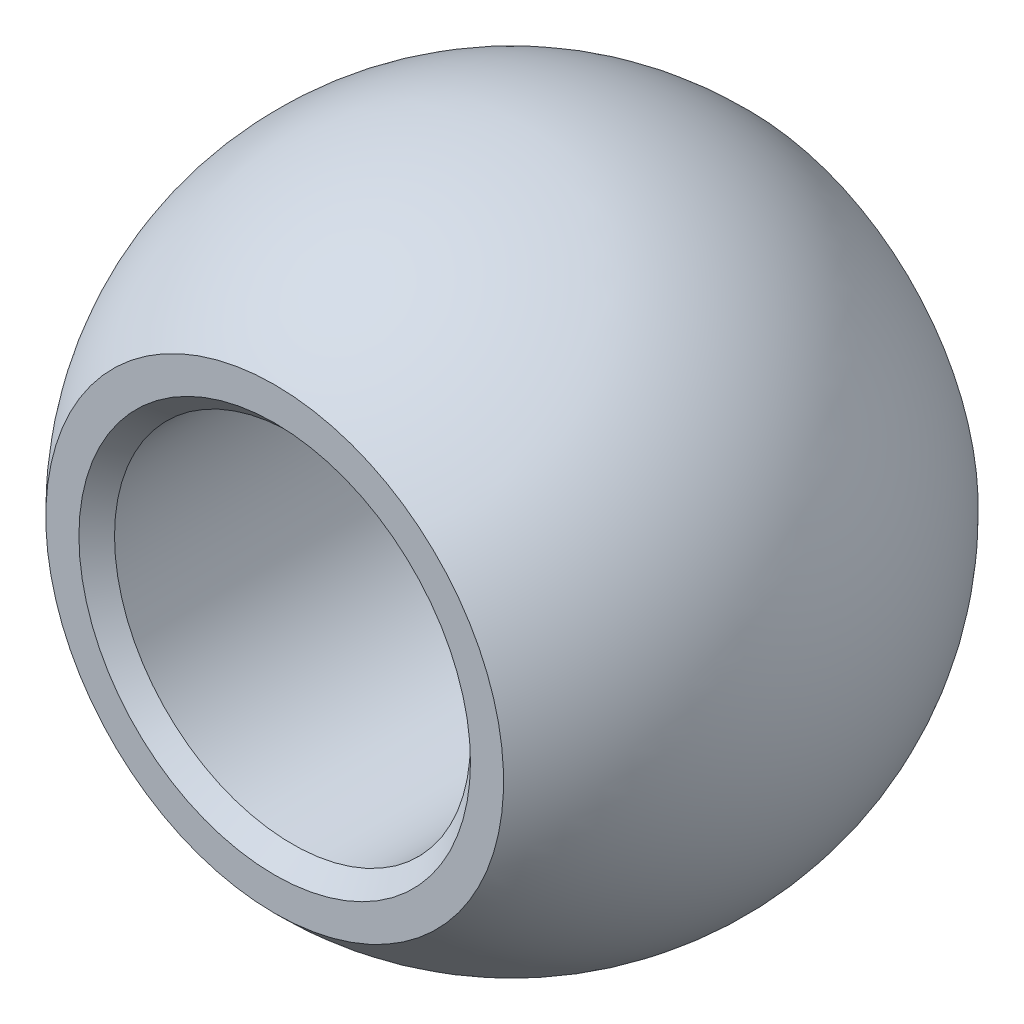
ISO-10303-21;
HEADER;
FILE_DESCRIPTION(('STEP AP214'),'2;1');
FILE_NAME('part.step','',(''),(''),'','','');
FILE_SCHEMA(('AUTOMOTIVE_DESIGN { 1 0 10303 214 1 1 1 1 }'));
ENDSEC;
DATA;
#1=APPLICATION_CONTEXT('core data for automotive mechanical design processes');
#2=APPLICATION_PROTOCOL_DEFINITION('international standard','automotive_design',2000,#1);
#3=PRODUCT_CONTEXT('',#1,'mechanical');
#4=PRODUCT('Part','Part','',(#3));
#5=PRODUCT_RELATED_PRODUCT_CATEGORY('part','',(#4));
#6=PRODUCT_DEFINITION_FORMATION('','',#4);
#7=PRODUCT_DEFINITION_CONTEXT('part definition',#1,'design');
#8=PRODUCT_DEFINITION('design','',#6,#7);
#9=PRODUCT_DEFINITION_SHAPE('','',#8);
#10=(LENGTH_UNIT() NAMED_UNIT(*) SI_UNIT(.MILLI.,.METRE.));
#11=(NAMED_UNIT(*) PLANE_ANGLE_UNIT() SI_UNIT($,.RADIAN.));
#12=(NAMED_UNIT(*) SI_UNIT($,.STERADIAN.) SOLID_ANGLE_UNIT());
#13=UNCERTAINTY_MEASURE_WITH_UNIT(LENGTH_MEASURE(1.E-05),#10,'distance_accuracy_value','');
#14=(GEOMETRIC_REPRESENTATION_CONTEXT(3) GLOBAL_UNCERTAINTY_ASSIGNED_CONTEXT((#13)) GLOBAL_UNIT_ASSIGNED_CONTEXT((#10,
#11,#12)) REPRESENTATION_CONTEXT('',''));
#15=CARTESIAN_POINT('',(0.,0.,0.));
#16=DIRECTION('',(0.,0.,1.));
#17=DIRECTION('',(1.,0.,0.));
#18=AXIS2_PLACEMENT_3D('',#15,#16,#17);
#19=CARTESIAN_POINT('',(0.,0.,0.));
#20=DIRECTION('',(0.,1.,0.));
#21=DIRECTION('',(1.,0.,0.));
#22=AXIS2_PLACEMENT_3D('',#19,#20,#21);
#23=SPHERICAL_SURFACE('',#22,11.115);
#24=CARTESIAN_POINT('',(0.,0.,0.));
#25=DIRECTION('',(0.,0.,1.));
#26=DIRECTION('',(0.,-1.,0.));
#27=AXIS2_PLACEMENT_3D('',#24,#25,#26);
#28=SPHERICAL_SURFACE('',#27,11.115);
#29=CARTESIAN_POINT('',(0.,0.,-8.));
#30=DIRECTION('',(0.,0.,1.));
#31=DIRECTION('',(0.,-1.,0.));
#32=AXIS2_PLACEMENT_3D('',#29,#30,#31);
#33=CIRCLE('',#32,7.71642566218324);
#34=CARTESIAN_POINT('',(0.,-7.71642566218324,-8.));
#35=VERTEX_POINT('',#34);
#36=EDGE_CURVE('E59',#35,#35,#33,.T.);
#37=ORIENTED_EDGE('',*,*,#36,.T.);
#38=EDGE_LOOP('',(#37));
#39=FACE_BOUND('',#38,.T.);
#40=CARTESIAN_POINT('',(0.,0.,8.));
#41=DIRECTION('',(0.,0.,-1.));
#42=DIRECTION('',(0.,1.,0.));
#43=AXIS2_PLACEMENT_3D('',#40,#41,#42);
#44=CIRCLE('',#43,7.71642566218323);
#45=CARTESIAN_POINT('',(0.,7.71642566218323,8.00000000000001));
#46=VERTEX_POINT('',#45);
#47=EDGE_CURVE('E58',#46,#46,#44,.T.);
#48=ORIENTED_EDGE('',*,*,#47,.T.);
#49=EDGE_LOOP('',(#48));
#50=FACE_BOUND('',#49,.T.);
#51=ADVANCED_FACE('F38',(#39,#50),#28,.T.);
#52=CARTESIAN_POINT('',(-11.115,18.,8.00000000000001));
#53=DIRECTION('',(0.,0.,-1.));
#54=DIRECTION('',(0.,1.,0.));
#55=AXIS2_PLACEMENT_3D('',#52,#53,#54);
#56=PLANE('',#55);
#57=CARTESIAN_POINT('',(0.,0.,8.));
#58=DIRECTION('',(0.,0.,-1.));
#59=DIRECTION('',(0.,1.,0.));
#60=AXIS2_PLACEMENT_3D('',#57,#58,#59);
#61=CIRCLE('',#60,6.6);
#62=CARTESIAN_POINT('',(0.,6.6,8.00000000000001));
#63=VERTEX_POINT('',#62);
#64=EDGE_CURVE('E10',#63,#63,#61,.T.);
#65=ORIENTED_EDGE('',*,*,#64,.T.);
#66=EDGE_LOOP('',(#65));
#67=FACE_BOUND('',#66,.T.);
#68=ORIENTED_EDGE('',*,*,#47,.F.);
#69=EDGE_LOOP('',(#68));
#70=FACE_BOUND('',#69,.T.);
#71=ADVANCED_FACE('F66',(#67,#70),#56,.F.);
#72=CARTESIAN_POINT('',(-11.115,18.,-7.99999999999999));
#73=DIRECTION('',(0.,0.,1.));
#74=DIRECTION('',(0.,-1.,0.));
#75=AXIS2_PLACEMENT_3D('',#72,#73,#74);
#76=PLANE('',#75);
#77=CARTESIAN_POINT('',(0.,0.,-8.));
#78=DIRECTION('',(0.,0.,1.));
#79=DIRECTION('',(0.,-1.,0.));
#80=AXIS2_PLACEMENT_3D('',#77,#78,#79);
#81=CIRCLE('',#80,6.6);
#82=CARTESIAN_POINT('',(0.,-6.6,-8.));
#83=VERTEX_POINT('',#82);
#84=EDGE_CURVE('E53',#83,#83,#81,.T.);
#85=ORIENTED_EDGE('',*,*,#84,.T.);
#86=EDGE_LOOP('',(#85));
#87=FACE_BOUND('',#86,.T.);
#88=ORIENTED_EDGE('',*,*,#36,.F.);
#89=EDGE_LOOP('',(#88));
#90=FACE_BOUND('',#89,.T.);
#91=ADVANCED_FACE('F68',(#87,#90),#76,.F.);
#92=CARTESIAN_POINT('',(0.,0.,-8.));
#93=DIRECTION('',(0.,0.,1.));
#94=DIRECTION('',(1.,0.,0.));
#95=AXIS2_PLACEMENT_3D('',#92,#93,#94);
#96=CYLINDRICAL_SURFACE('',#95,6.);
#97=CARTESIAN_POINT('',(0.,0.,-7.4));
#98=DIRECTION('',(0.,0.,1.));
#99=DIRECTION('',(1.,0.,0.));
#100=AXIS2_PLACEMENT_3D('',#97,#98,#99);
#101=CIRCLE('',#100,6.);
#102=CARTESIAN_POINT('',(6.,0.,-7.4));
#103=VERTEX_POINT('',#102);
#104=EDGE_CURVE('E45',#103,#103,#101,.F.);
#105=ORIENTED_EDGE('',*,*,#104,.T.);
#106=EDGE_LOOP('',(#105));
#107=FACE_BOUND('',#106,.T.);
#108=CARTESIAN_POINT('',(0.,0.,7.4));
#109=DIRECTION('',(0.,0.,-1.));
#110=DIRECTION('',(-1.,0.,0.));
#111=AXIS2_PLACEMENT_3D('',#108,#109,#110);
#112=CIRCLE('',#111,6.);
#113=CARTESIAN_POINT('',(-6.,0.,7.4));
#114=VERTEX_POINT('',#113);
#115=EDGE_CURVE('E49',#114,#114,#112,.F.);
#116=ORIENTED_EDGE('',*,*,#115,.T.);
#117=EDGE_LOOP('',(#116));
#118=FACE_BOUND('',#117,.T.);
#119=ADVANCED_FACE('F74',(#107,#118),#96,.F.);
#120=CARTESIAN_POINT('',(0.,0.,-8.));
#121=DIRECTION('',(0.,0.,-1.));
#122=DIRECTION('',(-1.,0.,0.));
#123=AXIS2_PLACEMENT_3D('',#120,#121,#122);
#124=CONICAL_SURFACE('',#123,6.6,0.785398163397448);
#125=ORIENTED_EDGE('',*,*,#104,.F.);
#126=EDGE_LOOP('',(#125));
#127=FACE_BOUND('',#126,.T.);
#128=ORIENTED_EDGE('',*,*,#84,.F.);
#129=EDGE_LOOP('',(#128));
#130=FACE_BOUND('',#129,.T.);
#131=ADVANCED_FACE('F80',(#127,#130),#124,.F.);
#132=CARTESIAN_POINT('',(0.,0.,7.4));
#133=DIRECTION('',(0.,0.,1.));
#134=DIRECTION('',(1.,0.,0.));
#135=AXIS2_PLACEMENT_3D('',#132,#133,#134);
#136=CONICAL_SURFACE('',#135,6.,0.78539816339745);
#137=ORIENTED_EDGE('',*,*,#64,.F.);
#138=EDGE_LOOP('',(#137));
#139=FACE_BOUND('',#138,.T.);
#140=ORIENTED_EDGE('',*,*,#115,.F.);
#141=EDGE_LOOP('',(#140));
#142=FACE_BOUND('',#141,.T.);
#143=ADVANCED_FACE('F40',(#139,#142),#136,.F.);
#144=CLOSED_SHELL('',(#51,#71,#91,#119,#131,#143));
#145=MANIFOLD_SOLID_BREP('B2',#144);
#146=ADVANCED_BREP_SHAPE_REPRESENTATION('',(#18,#145),#14);
#147=SHAPE_DEFINITION_REPRESENTATION(#9,#146);
ENDSEC;
END-ISO-10303-21;
